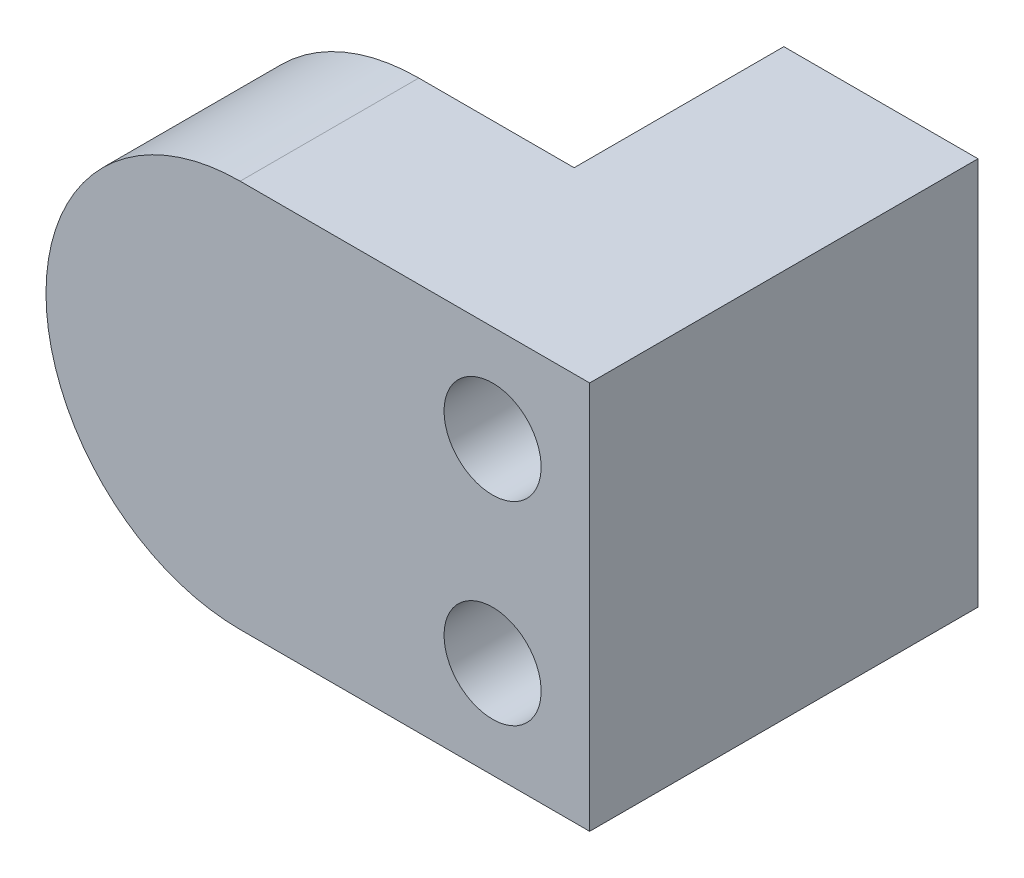
ISO-10303-21;
HEADER;
FILE_DESCRIPTION(('STEP AP214'),'2;1');
FILE_NAME('part.step','',(''),(''),'','','');
FILE_SCHEMA(('AUTOMOTIVE_DESIGN { 1 0 10303 214 1 1 1 1 }'));
ENDSEC;
DATA;
#1=APPLICATION_CONTEXT('core data for automotive mechanical design processes');
#2=APPLICATION_PROTOCOL_DEFINITION('international standard','automotive_design',2000,#1);
#3=PRODUCT_CONTEXT('',#1,'mechanical');
#4=PRODUCT('Part','Part','',(#3));
#5=PRODUCT_RELATED_PRODUCT_CATEGORY('part','',(#4));
#6=PRODUCT_DEFINITION_FORMATION('','',#4);
#7=PRODUCT_DEFINITION_CONTEXT('part definition',#1,'design');
#8=PRODUCT_DEFINITION('design','',#6,#7);
#9=PRODUCT_DEFINITION_SHAPE('','',#8);
#10=(LENGTH_UNIT() NAMED_UNIT(*) SI_UNIT(.MILLI.,.METRE.));
#11=(NAMED_UNIT(*) PLANE_ANGLE_UNIT() SI_UNIT($,.RADIAN.));
#12=(NAMED_UNIT(*) SI_UNIT($,.STERADIAN.) SOLID_ANGLE_UNIT());
#13=UNCERTAINTY_MEASURE_WITH_UNIT(LENGTH_MEASURE(1.E-05),#10,'distance_accuracy_value','');
#14=(GEOMETRIC_REPRESENTATION_CONTEXT(3) GLOBAL_UNCERTAINTY_ASSIGNED_CONTEXT((#13)) GLOBAL_UNIT_ASSIGNED_CONTEXT((#10,
#11,#12)) REPRESENTATION_CONTEXT('',''));
#15=CARTESIAN_POINT('',(0.,0.,0.));
#16=DIRECTION('',(0.,0.,1.));
#17=DIRECTION('',(1.,0.,0.));
#18=AXIS2_PLACEMENT_3D('',#15,#16,#17);
#19=CARTESIAN_POINT('',(-3.175,-6.35,13.208));
#20=DIRECTION('',(1.,0.,0.));
#21=DIRECTION('',(0.,0.,-1.));
#22=AXIS2_PLACEMENT_3D('',#19,#20,#21);
#23=PLANE('',#22);
#24=DIRECTION('',(0.,-1.,0.));
#25=VECTOR('',#24,1.);
#26=CARTESIAN_POINT('',(-3.175,-6.35,6.858));
#27=LINE('',#26,#25);
#28=CARTESIAN_POINT('',(-3.175,6.35,6.858));
#29=VERTEX_POINT('',#28);
#30=CARTESIAN_POINT('',(-3.175,-6.35,6.858));
#31=VERTEX_POINT('',#30);
#32=EDGE_CURVE('E57',#29,#31,#27,.T.);
#33=ORIENTED_EDGE('',*,*,#32,.F.);
#34=DIRECTION('',(0.,0.,-1.));
#35=VECTOR('',#34,1.);
#36=CARTESIAN_POINT('',(-3.175,6.35,13.208));
#37=LINE('',#36,#35);
#38=CARTESIAN_POINT('',(-3.175,6.35,0.));
#39=VERTEX_POINT('',#38);
#40=EDGE_CURVE('E48',#29,#39,#37,.T.);
#41=ORIENTED_EDGE('',*,*,#40,.T.);
#42=DIRECTION('',(0.,-1.,0.));
#43=VECTOR('',#42,1.);
#44=CARTESIAN_POINT('',(-3.175,-6.35,0.));
#45=LINE('',#44,#43);
#46=CARTESIAN_POINT('',(-3.175,-6.35,0.));
#47=VERTEX_POINT('',#46);
#48=EDGE_CURVE('E108',#39,#47,#45,.T.);
#49=ORIENTED_EDGE('',*,*,#48,.T.);
#50=DIRECTION('',(0.,0.,-1.));
#51=VECTOR('',#50,1.);
#52=CARTESIAN_POINT('',(-3.175,-6.35,13.208));
#53=LINE('',#52,#51);
#54=EDGE_CURVE('E96',#31,#47,#53,.T.);
#55=ORIENTED_EDGE('',*,*,#54,.F.);
#56=EDGE_LOOP('',(#33,#41,#49,#55));
#57=FACE_BOUND('',#56,.T.);
#58=ADVANCED_FACE('F38',(#57),#23,.F.);
#59=CARTESIAN_POINT('',(3.175,-6.35,13.208));
#60=DIRECTION('',(-1.,0.,0.));
#61=DIRECTION('',(0.,0.,1.));
#62=AXIS2_PLACEMENT_3D('',#59,#60,#61);
#63=PLANE('',#62);
#64=DIRECTION('',(0.,1.,0.));
#65=VECTOR('',#64,1.);
#66=CARTESIAN_POINT('',(3.175,-6.35,0.));
#67=LINE('',#66,#65);
#68=CARTESIAN_POINT('',(3.175,-6.35,0.));
#69=VERTEX_POINT('',#68);
#70=CARTESIAN_POINT('',(3.175,6.35,0.));
#71=VERTEX_POINT('',#70);
#72=EDGE_CURVE('E114',#69,#71,#67,.T.);
#73=ORIENTED_EDGE('',*,*,#72,.T.);
#74=DIRECTION('',(0.,0.,-1.));
#75=VECTOR('',#74,1.);
#76=CARTESIAN_POINT('',(3.175,6.35,13.208));
#77=LINE('',#76,#75);
#78=CARTESIAN_POINT('',(3.175,6.35,12.7));
#79=VERTEX_POINT('',#78);
#80=EDGE_CURVE('E12',#79,#71,#77,.T.);
#81=ORIENTED_EDGE('',*,*,#80,.F.);
#82=DIRECTION('',(0.,1.,0.));
#83=VECTOR('',#82,1.);
#84=CARTESIAN_POINT('',(3.175,0.,12.7));
#85=LINE('',#84,#83);
#86=CARTESIAN_POINT('',(3.175,-6.35,12.7));
#87=VERTEX_POINT('',#86);
#88=EDGE_CURVE('E107',#87,#79,#85,.T.);
#89=ORIENTED_EDGE('',*,*,#88,.F.);
#90=DIRECTION('',(0.,0.,-1.));
#91=VECTOR('',#90,1.);
#92=CARTESIAN_POINT('',(3.175,-6.35,13.208));
#93=LINE('',#92,#91);
#94=EDGE_CURVE('E102',#87,#69,#93,.T.);
#95=ORIENTED_EDGE('',*,*,#94,.T.);
#96=EDGE_LOOP('',(#73,#81,#89,#95));
#97=FACE_BOUND('',#96,.T.);
#98=ADVANCED_FACE('F112',(#97),#63,.F.);
#99=CARTESIAN_POINT('',(-3.175,6.35,13.208));
#100=DIRECTION('',(0.,-1.,0.));
#101=DIRECTION('',(0.,0.,-1.));
#102=AXIS2_PLACEMENT_3D('',#99,#100,#101);
#103=PLANE('',#102);
#104=DIRECTION('',(-1.,0.,0.));
#105=VECTOR('',#104,1.);
#106=CARTESIAN_POINT('',(-3.175,6.35,0.));
#107=LINE('',#106,#105);
#108=EDGE_CURVE('E119',#71,#39,#107,.T.);
#109=ORIENTED_EDGE('',*,*,#108,.T.);
#110=ORIENTED_EDGE('',*,*,#40,.F.);
#111=DIRECTION('',(1.,0.,0.));
#112=VECTOR('',#111,1.);
#113=CARTESIAN_POINT('',(-8.255,6.35,6.858));
#114=LINE('',#113,#112);
#115=CARTESIAN_POINT('',(-8.255,6.35,6.858));
#116=VERTEX_POINT('',#115);
#117=EDGE_CURVE('E84',#116,#29,#114,.T.);
#118=ORIENTED_EDGE('',*,*,#117,.F.);
#119=DIRECTION('',(0.,0.,-1.));
#120=VECTOR('',#119,1.);
#121=CARTESIAN_POINT('',(-8.255,6.35,13.208));
#122=LINE('',#121,#120);
#123=CARTESIAN_POINT('',(-8.255,6.35,12.7));
#124=VERTEX_POINT('',#123);
#125=EDGE_CURVE('E149',#124,#116,#122,.T.);
#126=ORIENTED_EDGE('',*,*,#125,.F.);
#127=DIRECTION('',(-1.,0.,0.));
#128=VECTOR('',#127,1.);
#129=CARTESIAN_POINT('',(0.,6.35,12.7));
#130=LINE('',#129,#128);
#131=EDGE_CURVE('E137',#79,#124,#130,.T.);
#132=ORIENTED_EDGE('',*,*,#131,.F.);
#133=ORIENTED_EDGE('',*,*,#80,.T.);
#134=EDGE_LOOP('',(#109,#110,#118,#126,#132,#133));
#135=FACE_BOUND('',#134,.T.);
#136=ADVANCED_FACE('F158',(#135),#103,.F.);
#137=CARTESIAN_POINT('',(-3.175,-6.35,13.208));
#138=DIRECTION('',(0.,1.,0.));
#139=DIRECTION('',(0.,0.,1.));
#140=AXIS2_PLACEMENT_3D('',#137,#138,#139);
#141=PLANE('',#140);
#142=DIRECTION('',(1.,0.,0.));
#143=VECTOR('',#142,1.);
#144=CARTESIAN_POINT('',(-3.175,-6.35,0.));
#145=LINE('',#144,#143);
#146=EDGE_CURVE('E99',#47,#69,#145,.T.);
#147=ORIENTED_EDGE('',*,*,#146,.T.);
#148=ORIENTED_EDGE('',*,*,#94,.F.);
#149=DIRECTION('',(1.,0.,0.));
#150=VECTOR('',#149,1.);
#151=CARTESIAN_POINT('',(0.,-6.35,12.7));
#152=LINE('',#151,#150);
#153=CARTESIAN_POINT('',(-8.255,-6.35,12.7));
#154=VERTEX_POINT('',#153);
#155=EDGE_CURVE('E74',#154,#87,#152,.T.);
#156=ORIENTED_EDGE('',*,*,#155,.F.);
#157=DIRECTION('',(0.,0.,1.));
#158=VECTOR('',#157,1.);
#159=CARTESIAN_POINT('',(-8.255,-6.35,13.208));
#160=LINE('',#159,#158);
#161=CARTESIAN_POINT('',(-8.255,-6.35,6.858));
#162=VERTEX_POINT('',#161);
#163=EDGE_CURVE('E155',#162,#154,#160,.T.);
#164=ORIENTED_EDGE('',*,*,#163,.F.);
#165=DIRECTION('',(1.,0.,0.));
#166=VECTOR('',#165,1.);
#167=CARTESIAN_POINT('',(-8.255,-6.35,6.858));
#168=LINE('',#167,#166);
#169=EDGE_CURVE('E122',#162,#31,#168,.T.);
#170=ORIENTED_EDGE('',*,*,#169,.T.);
#171=ORIENTED_EDGE('',*,*,#54,.T.);
#172=EDGE_LOOP('',(#147,#148,#156,#164,#170,#171));
#173=FACE_BOUND('',#172,.T.);
#174=ADVANCED_FACE('F101',(#173),#141,.F.);
#175=CARTESIAN_POINT('',(0.,0.,12.7));
#176=DIRECTION('',(0.,0.,-1.));
#177=DIRECTION('',(-1.,0.,0.));
#178=AXIS2_PLACEMENT_3D('',#175,#176,#177);
#179=PLANE('',#178);
#180=CARTESIAN_POINT('',(0.,3.175,12.7));
#181=DIRECTION('',(0.,0.,-1.));
#182=DIRECTION('',(-1.,0.,0.));
#183=AXIS2_PLACEMENT_3D('',#180,#181,#182);
#184=CIRCLE('',#183,1.5875);
#185=CARTESIAN_POINT('',(-1.5875,3.175,12.7));
#186=VERTEX_POINT('',#185);
#187=EDGE_CURVE('E129',#186,#186,#184,.F.);
#188=ORIENTED_EDGE('',*,*,#187,.F.);
#189=EDGE_LOOP('',(#188));
#190=FACE_BOUND('',#189,.T.);
#191=CARTESIAN_POINT('',(0.,-3.175,12.7));
#192=DIRECTION('',(0.,0.,-1.));
#193=DIRECTION('',(-1.,0.,0.));
#194=AXIS2_PLACEMENT_3D('',#191,#192,#193);
#195=CIRCLE('',#194,1.5875);
#196=CARTESIAN_POINT('',(-1.5875,-3.175,12.7));
#197=VERTEX_POINT('',#196);
#198=EDGE_CURVE('E133',#197,#197,#195,.F.);
#199=ORIENTED_EDGE('',*,*,#198,.F.);
#200=EDGE_LOOP('',(#199));
#201=FACE_BOUND('',#200,.T.);
#202=ORIENTED_EDGE('',*,*,#131,.T.);
#203=CARTESIAN_POINT('',(-8.255,0.,12.7));
#204=DIRECTION('',(0.,0.,-1.));
#205=DIRECTION('',(-1.,0.,0.));
#206=AXIS2_PLACEMENT_3D('',#203,#204,#205);
#207=CIRCLE('',#206,6.35);
#208=EDGE_CURVE('E42',#124,#154,#207,.F.);
#209=ORIENTED_EDGE('',*,*,#208,.T.);
#210=ORIENTED_EDGE('',*,*,#155,.T.);
#211=ORIENTED_EDGE('',*,*,#88,.T.);
#212=EDGE_LOOP('',(#202,#209,#210,#211));
#213=FACE_BOUND('',#212,.T.);
#214=ADVANCED_FACE('F40',(#190,#201,#213),#179,.F.);
#215=CARTESIAN_POINT('',(0.,0.,0.));
#216=DIRECTION('',(0.,0.,-1.));
#217=DIRECTION('',(-1.,0.,0.));
#218=AXIS2_PLACEMENT_3D('',#215,#216,#217);
#219=PLANE('',#218);
#220=CARTESIAN_POINT('',(0.,3.175,0.));
#221=DIRECTION('',(0.,0.,-1.));
#222=DIRECTION('',(-1.,0.,0.));
#223=AXIS2_PLACEMENT_3D('',#220,#221,#222);
#224=CIRCLE('',#223,1.5875);
#225=CARTESIAN_POINT('',(-1.5875,3.175,0.));
#226=VERTEX_POINT('',#225);
#227=EDGE_CURVE('E132',#226,#226,#224,.T.);
#228=ORIENTED_EDGE('',*,*,#227,.F.);
#229=EDGE_LOOP('',(#228));
#230=FACE_BOUND('',#229,.T.);
#231=CARTESIAN_POINT('',(0.,-3.175,0.));
#232=DIRECTION('',(0.,0.,-1.));
#233=DIRECTION('',(-1.,0.,0.));
#234=AXIS2_PLACEMENT_3D('',#231,#232,#233);
#235=CIRCLE('',#234,1.5875);
#236=CARTESIAN_POINT('',(-1.5875,-3.175,0.));
#237=VERTEX_POINT('',#236);
#238=EDGE_CURVE('E136',#237,#237,#235,.T.);
#239=ORIENTED_EDGE('',*,*,#238,.F.);
#240=EDGE_LOOP('',(#239));
#241=FACE_BOUND('',#240,.T.);
#242=ORIENTED_EDGE('',*,*,#72,.F.);
#243=ORIENTED_EDGE('',*,*,#146,.F.);
#244=ORIENTED_EDGE('',*,*,#48,.F.);
#245=ORIENTED_EDGE('',*,*,#108,.F.);
#246=EDGE_LOOP('',(#242,#243,#244,#245));
#247=FACE_BOUND('',#246,.T.);
#248=ADVANCED_FACE('F117',(#230,#241,#247),#219,.T.);
#249=CARTESIAN_POINT('',(-8.255,-6.35,6.858));
#250=DIRECTION('',(0.,0.,1.));
#251=DIRECTION('',(1.,0.,0.));
#252=AXIS2_PLACEMENT_3D('',#249,#250,#251);
#253=PLANE('',#252);
#254=ORIENTED_EDGE('',*,*,#169,.F.);
#255=CARTESIAN_POINT('',(-8.255,0.,6.858));
#256=DIRECTION('',(0.,0.,1.));
#257=DIRECTION('',(1.,0.,0.));
#258=AXIS2_PLACEMENT_3D('',#255,#256,#257);
#259=CIRCLE('',#258,6.35);
#260=EDGE_CURVE('E143',#162,#116,#259,.F.);
#261=ORIENTED_EDGE('',*,*,#260,.T.);
#262=ORIENTED_EDGE('',*,*,#117,.T.);
#263=ORIENTED_EDGE('',*,*,#32,.T.);
#264=EDGE_LOOP('',(#254,#261,#262,#263));
#265=FACE_BOUND('',#264,.T.);
#266=ADVANCED_FACE('F156',(#265),#253,.F.);
#267=CARTESIAN_POINT('',(-8.255,0.,-11.1025122421383));
#268=DIRECTION('',(0.,0.,1.));
#269=DIRECTION('',(1.,0.,0.));
#270=AXIS2_PLACEMENT_3D('',#267,#268,#269);
#271=CYLINDRICAL_SURFACE('',#270,6.35);
#272=ORIENTED_EDGE('',*,*,#260,.F.);
#273=ORIENTED_EDGE('',*,*,#163,.T.);
#274=ORIENTED_EDGE('',*,*,#208,.F.);
#275=ORIENTED_EDGE('',*,*,#125,.T.);
#276=EDGE_LOOP('',(#272,#273,#274,#275));
#277=FACE_BOUND('',#276,.T.);
#278=ADVANCED_FACE('F157',(#277),#271,.T.);
#279=CARTESIAN_POINT('',(0.,-3.175,17.6981280605346));
#280=DIRECTION('',(0.,0.,-1.));
#281=DIRECTION('',(-1.,0.,0.));
#282=AXIS2_PLACEMENT_3D('',#279,#280,#281);
#283=CYLINDRICAL_SURFACE('',#282,1.5875);
#284=ORIENTED_EDGE('',*,*,#198,.T.);
#285=EDGE_LOOP('',(#284));
#286=FACE_BOUND('',#285,.T.);
#287=ORIENTED_EDGE('',*,*,#238,.T.);
#288=EDGE_LOOP('',(#287));
#289=FACE_BOUND('',#288,.T.);
#290=ADVANCED_FACE('F183',(#286,#289),#283,.F.);
#291=CARTESIAN_POINT('',(0.,3.175,17.6981280605346));
#292=DIRECTION('',(0.,0.,-1.));
#293=DIRECTION('',(-1.,0.,0.));
#294=AXIS2_PLACEMENT_3D('',#291,#292,#293);
#295=CYLINDRICAL_SURFACE('',#294,1.5875);
#296=ORIENTED_EDGE('',*,*,#187,.T.);
#297=EDGE_LOOP('',(#296));
#298=FACE_BOUND('',#297,.T.);
#299=ORIENTED_EDGE('',*,*,#227,.T.);
#300=EDGE_LOOP('',(#299));
#301=FACE_BOUND('',#300,.T.);
#302=ADVANCED_FACE('F186',(#298,#301),#295,.F.);
#303=CLOSED_SHELL('',(#58,#98,#136,#174,#214,#248,#266,#278,#290,#302));
#304=MANIFOLD_SOLID_BREP('B2',#303);
#305=ADVANCED_BREP_SHAPE_REPRESENTATION('',(#18,#304),#14);
#306=SHAPE_DEFINITION_REPRESENTATION(#9,#305);
ENDSEC;
END-ISO-10303-21;
